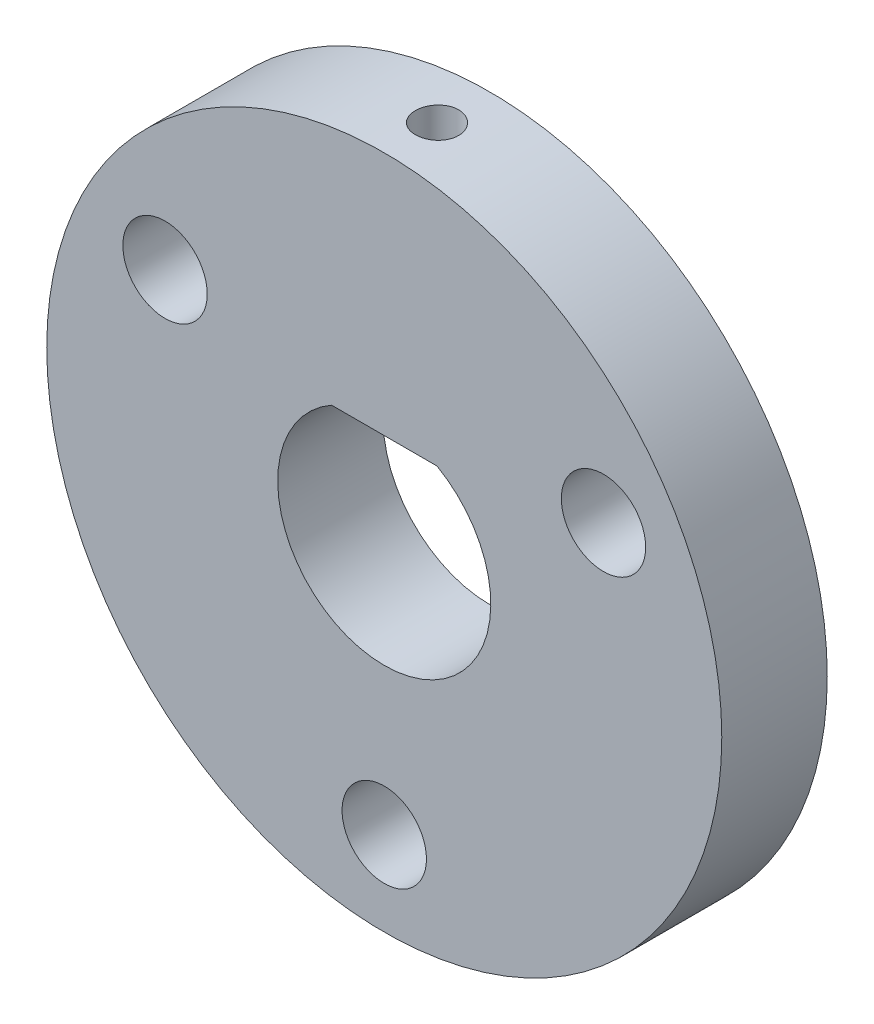
ISO-10303-21;
HEADER;
FILE_DESCRIPTION(('STEP AP214'),'2;1');
FILE_NAME('part.step','',(''),(''),'','','');
FILE_SCHEMA(('AUTOMOTIVE_DESIGN { 1 0 10303 214 1 1 1 1 }'));
ENDSEC;
DATA;
#1=APPLICATION_CONTEXT('core data for automotive mechanical design processes');
#2=APPLICATION_PROTOCOL_DEFINITION('international standard','automotive_design',2000,#1);
#3=PRODUCT_CONTEXT('',#1,'mechanical');
#4=PRODUCT('Part','Part','',(#3));
#5=PRODUCT_RELATED_PRODUCT_CATEGORY('part','',(#4));
#6=PRODUCT_DEFINITION_FORMATION('','',#4);
#7=PRODUCT_DEFINITION_CONTEXT('part definition',#1,'design');
#8=PRODUCT_DEFINITION('design','',#6,#7);
#9=PRODUCT_DEFINITION_SHAPE('','',#8);
#10=(LENGTH_UNIT() NAMED_UNIT(*) SI_UNIT(.MILLI.,.METRE.));
#11=(NAMED_UNIT(*) PLANE_ANGLE_UNIT() SI_UNIT($,.RADIAN.));
#12=(NAMED_UNIT(*) SI_UNIT($,.STERADIAN.) SOLID_ANGLE_UNIT());
#13=UNCERTAINTY_MEASURE_WITH_UNIT(LENGTH_MEASURE(1.E-05),#10,'distance_accuracy_value','');
#14=(GEOMETRIC_REPRESENTATION_CONTEXT(3) GLOBAL_UNCERTAINTY_ASSIGNED_CONTEXT((#13)) GLOBAL_UNIT_ASSIGNED_CONTEXT((#10,
#11,#12)) REPRESENTATION_CONTEXT('',''));
#15=CARTESIAN_POINT('',(0.,0.,0.));
#16=DIRECTION('',(0.,0.,1.));
#17=DIRECTION('',(1.,0.,0.));
#18=AXIS2_PLACEMENT_3D('',#15,#16,#17);
#19=CARTESIAN_POINT('',(0.,0.,2.5));
#20=DIRECTION('',(0.,0.,-1.));
#21=DIRECTION('',(-1.,0.,0.));
#22=AXIS2_PLACEMENT_3D('',#19,#20,#21);
#23=CYLINDRICAL_SURFACE('',#22,5.05);
#24=CARTESIAN_POINT('',(0.,0.,-2.5));
#25=DIRECTION('',(0.,0.,1.));
#26=DIRECTION('',(1.,0.,0.));
#27=AXIS2_PLACEMENT_3D('',#24,#25,#26);
#28=CIRCLE('',#27,5.05);
#29=CARTESIAN_POINT('',(-2.5,4.38776708588776,-2.5));
#30=VERTEX_POINT('',#29);
#31=CARTESIAN_POINT('',(2.5,4.38776708588776,-2.5));
#32=VERTEX_POINT('',#31);
#33=EDGE_CURVE('E88',#30,#32,#28,.T.);
#34=ORIENTED_EDGE('',*,*,#33,.F.);
#35=DIRECTION('',(0.,0.,-1.));
#36=VECTOR('',#35,1.);
#37=CARTESIAN_POINT('',(-2.5,4.38776708588776,2.5));
#38=LINE('',#37,#36);
#39=CARTESIAN_POINT('',(-2.5,4.38776708588776,2.5));
#40=VERTEX_POINT('',#39);
#41=EDGE_CURVE('E66',#40,#30,#38,.T.);
#42=ORIENTED_EDGE('',*,*,#41,.F.);
#43=CARTESIAN_POINT('',(0.,0.,2.5));
#44=DIRECTION('',(0.,0.,1.));
#45=DIRECTION('',(1.,0.,0.));
#46=AXIS2_PLACEMENT_3D('',#43,#44,#45);
#47=CIRCLE('',#46,5.05);
#48=CARTESIAN_POINT('',(2.5,4.38776708588776,2.5));
#49=VERTEX_POINT('',#48);
#50=EDGE_CURVE('E89',#40,#49,#47,.T.);
#51=ORIENTED_EDGE('',*,*,#50,.T.);
#52=DIRECTION('',(0.,0.,-1.));
#53=VECTOR('',#52,1.);
#54=CARTESIAN_POINT('',(2.5,4.38776708588776,2.5));
#55=LINE('',#54,#53);
#56=EDGE_CURVE('E86',#49,#32,#55,.T.);
#57=ORIENTED_EDGE('',*,*,#56,.T.);
#58=EDGE_LOOP('',(#34,#42,#51,#57));
#59=FACE_BOUND('',#58,.T.);
#60=ADVANCED_FACE('F53',(#59),#23,.F.);
#61=CARTESIAN_POINT('',(0.,4.38776708588776,2.5));
#62=DIRECTION('',(0.,1.,0.));
#63=DIRECTION('',(0.,0.,1.));
#64=AXIS2_PLACEMENT_3D('',#61,#62,#63);
#65=PLANE('',#64);
#66=CARTESIAN_POINT('',(0.,4.38776708588776,0.));
#67=DIRECTION('',(0.,-1.,0.));
#68=DIRECTION('',(0.,0.,-1.));
#69=AXIS2_PLACEMENT_3D('',#66,#67,#68);
#70=CIRCLE('',#69,1.02499999999999);
#71=CARTESIAN_POINT('',(0.,4.38776708588776,-1.02499999999999));
#72=VERTEX_POINT('',#71);
#73=EDGE_CURVE('E126',#72,#72,#70,.T.);
#74=ORIENTED_EDGE('',*,*,#73,.F.);
#75=EDGE_LOOP('',(#74));
#76=FACE_BOUND('',#75,.T.);
#77=DIRECTION('',(1.,0.,0.));
#78=VECTOR('',#77,1.);
#79=CARTESIAN_POINT('',(0.,4.38776708588776,-2.5));
#80=LINE('',#79,#78);
#81=EDGE_CURVE('E92',#30,#32,#80,.T.);
#82=ORIENTED_EDGE('',*,*,#81,.T.);
#83=ORIENTED_EDGE('',*,*,#56,.F.);
#84=DIRECTION('',(1.,0.,0.));
#85=VECTOR('',#84,1.);
#86=CARTESIAN_POINT('',(0.,4.38776708588776,2.5));
#87=LINE('',#86,#85);
#88=EDGE_CURVE('E73',#40,#49,#87,.T.);
#89=ORIENTED_EDGE('',*,*,#88,.F.);
#90=ORIENTED_EDGE('',*,*,#41,.T.);
#91=EDGE_LOOP('',(#82,#83,#89,#90));
#92=FACE_BOUND('',#91,.T.);
#93=ADVANCED_FACE('F93',(#76,#92),#65,.F.);
#94=CARTESIAN_POINT('',(0.,0.,2.5));
#95=DIRECTION('',(0.,0.,-1.));
#96=DIRECTION('',(-1.,0.,0.));
#97=AXIS2_PLACEMENT_3D('',#94,#95,#96);
#98=CYLINDRICAL_SURFACE('',#97,16.);
#99=CARTESIAN_POINT('',(0.,16.,-1.02499999999999));
#100=CARTESIAN_POINT('',(0.0575114207331277,15.9999995639404,-1.02499747062252));
#101=CARTESIAN_POINT('',(0.115063037927094,15.9996866004324,-1.02014339711077));
#102=CARTESIAN_POINT('',(0.228576932863279,15.9984682150002,-1.00084932507264));
#103=CARTESIAN_POINT('',(0.284537285086466,15.9975621047193,-0.986398188710879));
#104=CARTESIAN_POINT('',(0.393207978940733,15.9952599239394,-0.94832694926473));
#105=CARTESIAN_POINT('',(0.445920025973097,15.9938641131609,-0.924711705805202));
#106=CARTESIAN_POINT('',(0.546618270273278,15.9907394912123,-0.868990535478512));
#107=CARTESIAN_POINT('',(0.594605541757688,15.9890107560009,-0.836886544743876));
#108=CARTESIAN_POINT('',(0.684580918705194,15.9854115532959,-0.765044166979552));
#109=CARTESIAN_POINT('',(0.726560643741611,15.9835408932762,-0.725295293081125));
#110=CARTESIAN_POINT('',(0.803257589717148,15.9798703166809,-0.639313138883363));
#111=CARTESIAN_POINT('',(0.837974506203093,15.9780704030734,-0.593079586885333));
#112=CARTESIAN_POINT('',(0.899186413929757,15.9747428055375,-0.495392709416241));
#113=CARTESIAN_POINT('',(0.92567440496987,15.9732153538553,-0.443934988934735));
#114=CARTESIAN_POINT('',(0.969631780060977,15.9706074366134,-0.337291268295252));
#115=CARTESIAN_POINT('',(0.987101265131957,15.9695269660468,-0.282105309906628));
#116=CARTESIAN_POINT('',(1.01250237302976,15.9679366978974,-0.169652696826169));
#117=CARTESIAN_POINT('',(1.02044717605212,15.9674261117799,-0.112389030644394));
#118=CARTESIAN_POINT('',(1.02661408520189,15.9670308305007,0.00266121887982437));
#119=CARTESIAN_POINT('',(1.0248363061451,15.9671461279479,0.0604477960390674));
#120=CARTESIAN_POINT('',(1.01161945005532,15.967988879691,0.174813675676012));
#121=CARTESIAN_POINT('',(1.0001946398804,15.9687154300079,0.23139463451069));
#122=CARTESIAN_POINT('',(0.968030161283515,15.9706973876507,0.341834056400641));
#123=CARTESIAN_POINT('',(0.947290434744897,15.9719527982762,0.395692502467566));
#124=CARTESIAN_POINT('',(0.897068666568429,15.9748520419743,0.499203864306663));
#125=CARTESIAN_POINT('',(0.86758015771469,15.9764961622031,0.548853633938576));
#126=CARTESIAN_POINT('',(0.800702580636378,15.9799872599129,0.642503871146193));
#127=CARTESIAN_POINT('',(0.763313418947771,15.9818342397936,0.686504271880454));
#128=CARTESIAN_POINT('',(0.68161554573582,15.9855269318451,0.767689765234171));
#129=CARTESIAN_POINT('',(0.637294487927045,15.9873726357354,0.804862435160412));
#130=CARTESIAN_POINT('',(0.543034203505131,15.9908515829697,0.871241433990298));
#131=CARTESIAN_POINT('',(0.493094974834903,15.9924848262358,0.90044775997706));
#132=CARTESIAN_POINT('',(0.389008371210679,15.9953549521325,0.950063976516095));
#133=CARTESIAN_POINT('',(0.334860768875096,15.9965918133276,0.97047339137413));
#134=CARTESIAN_POINT('',(0.223897858100672,15.9985295147316,1.00190811248926));
#135=CARTESIAN_POINT('',(0.16708258239997,15.9992303615167,1.01293353387656));
#136=CARTESIAN_POINT('',(0.0525048793383818,16.0000162133585,1.02527189173401));
#137=CARTESIAN_POINT('',(-0.00525569144706847,16.0001023073919,1.02660200262234));
#138=CARTESIAN_POINT('',(-0.120179119460115,15.9996518496048,1.01955686418467));
#139=CARTESIAN_POINT('',(-0.177341979956248,15.9991153011911,1.01118166795949));
#140=CARTESIAN_POINT('',(-0.289398922550957,15.9974806572695,0.984977877797534));
#141=CARTESIAN_POINT('',(-0.344294855889152,15.9963830301646,0.967157168760082));
#142=CARTESIAN_POINT('',(-0.450316801149676,15.9937497034658,0.922576228970793));
#143=CARTESIAN_POINT('',(-0.501442777458349,15.9922139997342,0.895815913782377));
#144=CARTESIAN_POINT('',(-0.598552144920823,15.98887433674,0.834071706044386));
#145=CARTESIAN_POINT('',(-0.644528233799166,15.9870700048074,0.79907634916079));
#146=CARTESIAN_POINT('',(-0.729959210171678,15.983397371641,0.721872126747497));
#147=CARTESIAN_POINT('',(-0.769414030286373,15.9815290697463,0.679663186694315));
#148=CARTESIAN_POINT('',(-0.840740716507644,15.9779359086513,0.589155830439336));
#149=CARTESIAN_POINT('',(-0.872601436306932,15.9762112626874,0.54084862047849));
#150=CARTESIAN_POINT('',(-0.927759256402438,15.9731033055464,0.439560159647293));
#151=CARTESIAN_POINT('',(-0.951056411672044,15.9717199921782,0.386578938784235));
#152=CARTESIAN_POINT('',(-0.988406501281347,15.9694522406263,0.277487030259627));
#153=CARTESIAN_POINT('',(-1.00246643856869,15.9685674245931,0.221378748386596));
#154=CARTESIAN_POINT('',(-1.02096584894632,15.9673954039073,0.10759203731252));
#155=CARTESIAN_POINT('',(-1.02540542328849,15.9671081929651,0.0499136246431715));
#156=CARTESIAN_POINT('',(-1.02453709746525,15.9671639243402,-0.065265242291484));
#157=CARTESIAN_POINT('',(-1.01924672016003,15.967505733843,-0.122765830028862));
#158=CARTESIAN_POINT('',(-0.999105008747903,15.9687785882727,-0.236060448850491));
#159=CARTESIAN_POINT('',(-0.984253657463365,15.9697096342582,-0.291854476868476));
#160=CARTESIAN_POINT('',(-0.945415553165049,15.9720557636906,-0.40015472650357));
#161=CARTESIAN_POINT('',(-0.921428888726068,15.9734708424444,-0.452660979992762));
#162=CARTESIAN_POINT('',(-0.865003420979729,15.9766255519086,-0.55290334059572));
#163=CARTESIAN_POINT('',(-0.832564830946803,15.9783651744291,-0.600639568033454));
#164=CARTESIAN_POINT('',(-0.760091422341342,15.9819765954915,-0.69007576415085));
#165=CARTESIAN_POINT('',(-0.720043904560503,15.9838486116702,-0.73176543310074));
#166=CARTESIAN_POINT('',(-0.633507093288309,15.9875120052057,-0.80784480854172));
#167=CARTESIAN_POINT('',(-0.587016227284495,15.9893033627359,-0.842232727822479));
#168=CARTESIAN_POINT('',(-0.488857150139659,15.9926055308171,-0.902759101597657));
#169=CARTESIAN_POINT('',(-0.437182403500626,15.9941159801972,-0.928886965708121));
#170=CARTESIAN_POINT('',(-0.330207277441435,15.9966813388134,-0.972063609804729));
#171=CARTESIAN_POINT('',(-0.274911224715505,15.9977367806487,-0.989123010167669));
#172=CARTESIAN_POINT('',(-0.182731369403639,15.9989969841195,-1.00925039720182));
#173=CARTESIAN_POINT('',(-0.146443226441854,15.9993714408293,-1.01514884740438));
#174=CARTESIAN_POINT('',(-0.0734421868221183,15.9998730878324,-1.02302445362615));
#175=CARTESIAN_POINT('',(-0.0367292907843682,16.0000002784866,-1.02500161537029));
#176=CARTESIAN_POINT('',(0.,16.,-1.02499999999999));
#177=B_SPLINE_CURVE_WITH_KNOTS('',3,(#99,#100,#101,#102,#103,#104,#105,#106,#107,#108,#109,#110,
#111,#112,#113,#114,#115,#116,#117,#118,#119,#120,#121,#122,#123,#124,#125,#126,#127,#128,#129,
#130,#131,#132,#133,#134,#135,#136,#137,#138,#139,#140,#141,#142,#143,#144,#145,#146,#147,#148,
#149,#150,#151,#152,#153,#154,#155,#156,#157,#158,#159,#160,#161,#162,#163,#164,#165,#166,#167,
#168,#169,#170,#171,#172,#173,#174,#175,#176),.UNSPECIFIED.,.T.,.F.,(4,2,2,2,2,2,2,2,2,2,2,2,2,
2,2,2,2,2,2,2,2,2,2,2,2,2,2,2,2,2,2,2,2,2,2,2,2,2,4),(0.,0.172400177307407,0.345000783458068,
0.517509986212084,0.689979876569243,0.862688062012723,1.03540348584386,1.20826543582155,
1.38112544945959,1.55374598336394,1.72636447876437,1.89872813731454,2.07109287127302,
2.24358533834567,2.41607984610341,2.58888515507095,2.76169052731121,2.93450524285491,
3.10731783814117,3.27982423604565,3.45232969011708,3.62469136683436,3.79705467159224,
3.9696593648469,4.14226584138747,4.31512412366155,4.48798129626087,4.66070727017223,
4.83343142617767,5.00584482441623,5.17825853242072,5.35067056876706,5.52307825491913,
5.69577625605528,5.86851647895786,6.0414772857391,6.21423508365011,6.32433748431349,
6.43443972423178),.UNSPECIFIED.);
#178=CARTESIAN_POINT('',(0.,16.,-1.02499999999999));
#179=VERTEX_POINT('',#178);
#180=EDGE_CURVE('E11',#179,#179,#177,.T.);
#181=ORIENTED_EDGE('',*,*,#180,.T.);
#182=EDGE_LOOP('',(#181));
#183=FACE_BOUND('',#182,.T.);
#184=CARTESIAN_POINT('',(0.,0.,2.5));
#185=DIRECTION('',(0.,0.,1.));
#186=DIRECTION('',(1.,0.,0.));
#187=AXIS2_PLACEMENT_3D('',#184,#185,#186);
#188=CIRCLE('',#187,16.);
#189=CARTESIAN_POINT('',(16.,0.,2.5));
#190=VERTEX_POINT('',#189);
#191=EDGE_CURVE('E90',#190,#190,#188,.T.);
#192=ORIENTED_EDGE('',*,*,#191,.F.);
#193=EDGE_LOOP('',(#192));
#194=FACE_BOUND('',#193,.T.);
#195=CARTESIAN_POINT('',(0.,0.,-2.5));
#196=DIRECTION('',(0.,0.,1.));
#197=DIRECTION('',(1.,0.,0.));
#198=AXIS2_PLACEMENT_3D('',#195,#196,#197);
#199=CIRCLE('',#198,16.);
#200=CARTESIAN_POINT('',(16.,0.,-2.5));
#201=VERTEX_POINT('',#200);
#202=EDGE_CURVE('E95',#201,#201,#199,.T.);
#203=ORIENTED_EDGE('',*,*,#202,.T.);
#204=EDGE_LOOP('',(#203));
#205=FACE_BOUND('',#204,.T.);
#206=ADVANCED_FACE('F134',(#183,#194,#205),#98,.T.);
#207=CARTESIAN_POINT('',(0.,0.,2.5));
#208=DIRECTION('',(0.,0.,1.));
#209=DIRECTION('',(1.,0.,0.));
#210=AXIS2_PLACEMENT_3D('',#207,#208,#209);
#211=PLANE('',#210);
#212=CARTESIAN_POINT('',(-10.3923048454133,5.9999999999999,2.5));
#213=DIRECTION('',(0.,0.,1.));
#214=DIRECTION('',(1.,0.,0.));
#215=AXIS2_PLACEMENT_3D('',#212,#213,#214);
#216=CIRCLE('',#215,2.);
#217=CARTESIAN_POINT('',(-8.39230484541332,5.9999999999999,2.5));
#218=VERTEX_POINT('',#217);
#219=EDGE_CURVE('E123',#218,#218,#216,.T.);
#220=ORIENTED_EDGE('',*,*,#219,.F.);
#221=EDGE_LOOP('',(#220));
#222=FACE_BOUND('',#221,.T.);
#223=CARTESIAN_POINT('',(10.3923048454132,6.00000000000005,2.5));
#224=DIRECTION('',(0.,0.,1.));
#225=DIRECTION('',(1.,0.,0.));
#226=AXIS2_PLACEMENT_3D('',#223,#224,#225);
#227=CIRCLE('',#226,2.);
#228=CARTESIAN_POINT('',(12.3923048454132,6.00000000000005,2.5));
#229=VERTEX_POINT('',#228);
#230=EDGE_CURVE('E117',#229,#229,#227,.T.);
#231=ORIENTED_EDGE('',*,*,#230,.F.);
#232=EDGE_LOOP('',(#231));
#233=FACE_BOUND('',#232,.T.);
#234=CARTESIAN_POINT('',(0.,-12.,2.5));
#235=DIRECTION('',(0.,0.,1.));
#236=DIRECTION('',(1.,0.,0.));
#237=AXIS2_PLACEMENT_3D('',#234,#235,#236);
#238=CIRCLE('',#237,2.);
#239=CARTESIAN_POINT('',(2.,-12.,2.5));
#240=VERTEX_POINT('',#239);
#241=EDGE_CURVE('E102',#240,#240,#238,.T.);
#242=ORIENTED_EDGE('',*,*,#241,.F.);
#243=EDGE_LOOP('',(#242));
#244=FACE_BOUND('',#243,.T.);
#245=ORIENTED_EDGE('',*,*,#50,.F.);
#246=ORIENTED_EDGE('',*,*,#88,.T.);
#247=EDGE_LOOP('',(#245,#246));
#248=FACE_BOUND('',#247,.T.);
#249=ORIENTED_EDGE('',*,*,#191,.T.);
#250=EDGE_LOOP('',(#249));
#251=FACE_BOUND('',#250,.T.);
#252=ADVANCED_FACE('F139',(#222,#233,#244,#248,#251),#211,.T.);
#253=CARTESIAN_POINT('',(0.,0.,-2.5));
#254=DIRECTION('',(0.,0.,1.));
#255=DIRECTION('',(1.,0.,0.));
#256=AXIS2_PLACEMENT_3D('',#253,#254,#255);
#257=PLANE('',#256);
#258=CARTESIAN_POINT('',(-10.3923048454133,5.9999999999999,-2.5));
#259=DIRECTION('',(0.,0.,1.));
#260=DIRECTION('',(1.,0.,0.));
#261=AXIS2_PLACEMENT_3D('',#258,#259,#260);
#262=CIRCLE('',#261,2.);
#263=CARTESIAN_POINT('',(-8.39230484541332,5.9999999999999,-2.5));
#264=VERTEX_POINT('',#263);
#265=EDGE_CURVE('E120',#264,#264,#262,.T.);
#266=ORIENTED_EDGE('',*,*,#265,.T.);
#267=EDGE_LOOP('',(#266));
#268=FACE_BOUND('',#267,.T.);
#269=CARTESIAN_POINT('',(10.3923048454132,6.00000000000005,-2.5));
#270=DIRECTION('',(0.,0.,1.));
#271=DIRECTION('',(1.,0.,0.));
#272=AXIS2_PLACEMENT_3D('',#269,#270,#271);
#273=CIRCLE('',#272,2.);
#274=CARTESIAN_POINT('',(12.3923048454132,6.00000000000005,-2.5));
#275=VERTEX_POINT('',#274);
#276=EDGE_CURVE('E114',#275,#275,#273,.T.);
#277=ORIENTED_EDGE('',*,*,#276,.T.);
#278=EDGE_LOOP('',(#277));
#279=FACE_BOUND('',#278,.T.);
#280=CARTESIAN_POINT('',(0.,-12.,-2.5));
#281=DIRECTION('',(0.,0.,1.));
#282=DIRECTION('',(1.,0.,0.));
#283=AXIS2_PLACEMENT_3D('',#280,#281,#282);
#284=CIRCLE('',#283,2.);
#285=CARTESIAN_POINT('',(2.,-12.,-2.5));
#286=VERTEX_POINT('',#285);
#287=EDGE_CURVE('E99',#286,#286,#284,.T.);
#288=ORIENTED_EDGE('',*,*,#287,.T.);
#289=EDGE_LOOP('',(#288));
#290=FACE_BOUND('',#289,.T.);
#291=ORIENTED_EDGE('',*,*,#33,.T.);
#292=ORIENTED_EDGE('',*,*,#81,.F.);
#293=EDGE_LOOP('',(#291,#292));
#294=FACE_BOUND('',#293,.T.);
#295=ORIENTED_EDGE('',*,*,#202,.F.);
#296=EDGE_LOOP('',(#295));
#297=FACE_BOUND('',#296,.T.);
#298=ADVANCED_FACE('F97',(#268,#279,#290,#294,#297),#257,.F.);
#299=CARTESIAN_POINT('',(0.,-12.,2.5));
#300=DIRECTION('',(0.,0.,1.));
#301=DIRECTION('',(1.,0.,0.));
#302=AXIS2_PLACEMENT_3D('',#299,#300,#301);
#303=CYLINDRICAL_SURFACE('',#302,2.);
#304=ORIENTED_EDGE('',*,*,#287,.F.);
#305=EDGE_LOOP('',(#304));
#306=FACE_BOUND('',#305,.T.);
#307=ORIENTED_EDGE('',*,*,#241,.T.);
#308=EDGE_LOOP('',(#307));
#309=FACE_BOUND('',#308,.T.);
#310=ADVANCED_FACE('F146',(#306,#309),#303,.F.);
#311=CARTESIAN_POINT('',(10.3923048454132,6.00000000000005,2.5));
#312=DIRECTION('',(0.,0.,1.));
#313=DIRECTION('',(1.,0.,0.));
#314=AXIS2_PLACEMENT_3D('',#311,#312,#313);
#315=CYLINDRICAL_SURFACE('',#314,2.);
#316=ORIENTED_EDGE('',*,*,#276,.F.);
#317=EDGE_LOOP('',(#316));
#318=FACE_BOUND('',#317,.T.);
#319=ORIENTED_EDGE('',*,*,#230,.T.);
#320=EDGE_LOOP('',(#319));
#321=FACE_BOUND('',#320,.T.);
#322=ADVANCED_FACE('F153',(#318,#321),#315,.F.);
#323=CARTESIAN_POINT('',(-10.3923048454133,5.9999999999999,2.5));
#324=DIRECTION('',(0.,0.,1.));
#325=DIRECTION('',(1.,0.,0.));
#326=AXIS2_PLACEMENT_3D('',#323,#324,#325);
#327=CYLINDRICAL_SURFACE('',#326,2.);
#328=ORIENTED_EDGE('',*,*,#265,.F.);
#329=EDGE_LOOP('',(#328));
#330=FACE_BOUND('',#329,.T.);
#331=ORIENTED_EDGE('',*,*,#219,.T.);
#332=EDGE_LOOP('',(#331));
#333=FACE_BOUND('',#332,.T.);
#334=ADVANCED_FACE('F157',(#330,#333),#327,.F.);
#335=CARTESIAN_POINT('',(0.,4.38776708588776,0.));
#336=DIRECTION('',(0.,-1.,0.));
#337=DIRECTION('',(0.,0.,-1.));
#338=AXIS2_PLACEMENT_3D('',#335,#336,#337);
#339=CYLINDRICAL_SURFACE('',#338,1.02499999999999);
#340=ORIENTED_EDGE('',*,*,#73,.T.);
#341=EDGE_LOOP('',(#340));
#342=FACE_BOUND('',#341,.T.);
#343=ORIENTED_EDGE('',*,*,#180,.F.);
#344=EDGE_LOOP('',(#343));
#345=FACE_BOUND('',#344,.T.);
#346=ADVANCED_FACE('F130',(#342,#345),#339,.F.);
#347=CLOSED_SHELL('',(#60,#93,#206,#252,#298,#310,#322,#334,#346));
#348=MANIFOLD_SOLID_BREP('B2',#347);
#349=ADVANCED_BREP_SHAPE_REPRESENTATION('',(#18,#348),#14);
#350=SHAPE_DEFINITION_REPRESENTATION(#9,#349);
ENDSEC;
END-ISO-10303-21;
